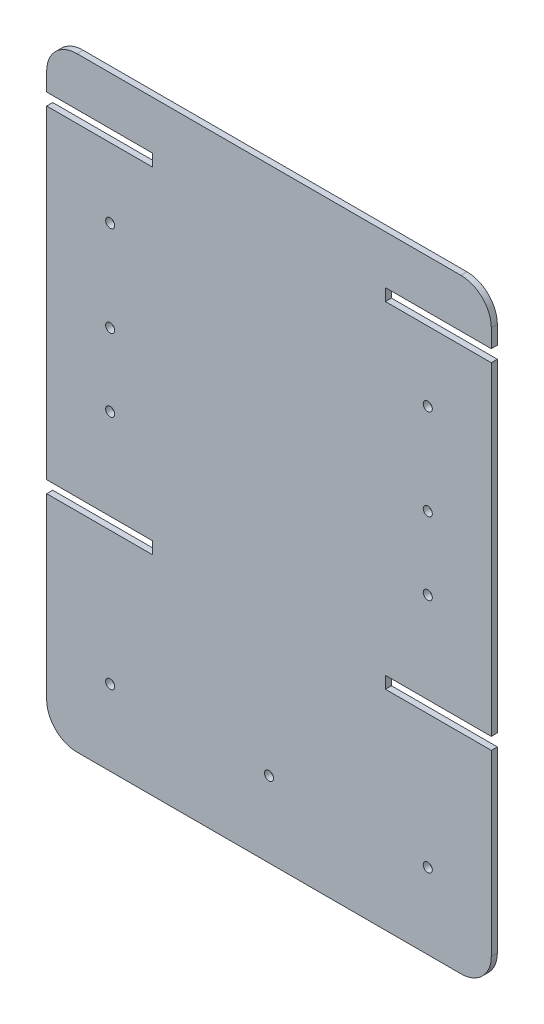
ISO-10303-21;
HEADER;
FILE_DESCRIPTION(('STEP AP214'),'2;1');
FILE_NAME('part.step','',(''),(''),'','','');
FILE_SCHEMA(('AUTOMOTIVE_DESIGN { 1 0 10303 214 1 1 1 1 }'));
ENDSEC;
DATA;
#1=APPLICATION_CONTEXT('core data for automotive mechanical design processes');
#2=APPLICATION_PROTOCOL_DEFINITION('international standard','automotive_design',2000,#1);
#3=PRODUCT_CONTEXT('',#1,'mechanical');
#4=PRODUCT('Part','Part','',(#3));
#5=PRODUCT_RELATED_PRODUCT_CATEGORY('part','',(#4));
#6=PRODUCT_DEFINITION_FORMATION('','',#4);
#7=PRODUCT_DEFINITION_CONTEXT('part definition',#1,'design');
#8=PRODUCT_DEFINITION('design','',#6,#7);
#9=PRODUCT_DEFINITION_SHAPE('','',#8);
#10=(LENGTH_UNIT() NAMED_UNIT(*) SI_UNIT(.MILLI.,.METRE.));
#11=(NAMED_UNIT(*) PLANE_ANGLE_UNIT() SI_UNIT($,.RADIAN.));
#12=(NAMED_UNIT(*) SI_UNIT($,.STERADIAN.) SOLID_ANGLE_UNIT());
#13=UNCERTAINTY_MEASURE_WITH_UNIT(LENGTH_MEASURE(1.E-05),#10,'distance_accuracy_value','');
#14=(GEOMETRIC_REPRESENTATION_CONTEXT(3) GLOBAL_UNCERTAINTY_ASSIGNED_CONTEXT((#13)) GLOBAL_UNIT_ASSIGNED_CONTEXT((#10,
#11,#12)) REPRESENTATION_CONTEXT('',''));
#15=CARTESIAN_POINT('',(0.,0.,0.));
#16=DIRECTION('',(0.,0.,1.));
#17=DIRECTION('',(1.,0.,0.));
#18=AXIS2_PLACEMENT_3D('',#15,#16,#17);
#19=CARTESIAN_POINT('',(-73.5,80.,2.));
#20=DIRECTION('',(0.,-1.,0.));
#21=DIRECTION('',(1.,0.,0.));
#22=AXIS2_PLACEMENT_3D('',#19,#20,#21);
#23=PLANE('',#22);
#24=DIRECTION('',(-1.,0.,0.));
#25=VECTOR('',#24,1.);
#26=CARTESIAN_POINT('',(-73.5,80.,0.));
#27=LINE('',#26,#25);
#28=CARTESIAN_POINT('',(-38.5,80.,0.));
#29=VERTEX_POINT('',#28);
#30=CARTESIAN_POINT('',(-73.5,80.,0.));
#31=VERTEX_POINT('',#30);
#32=EDGE_CURVE('E225',#29,#31,#27,.T.);
#33=ORIENTED_EDGE('',*,*,#32,.T.);
#34=DIRECTION('',(0.,0.,-1.));
#35=VECTOR('',#34,1.);
#36=CARTESIAN_POINT('',(-73.5,80.,2.));
#37=LINE('',#36,#35);
#38=CARTESIAN_POINT('',(-73.5,80.,2.));
#39=VERTEX_POINT('',#38);
#40=EDGE_CURVE('E11',#39,#31,#37,.T.);
#41=ORIENTED_EDGE('',*,*,#40,.F.);
#42=DIRECTION('',(-1.,0.,0.));
#43=VECTOR('',#42,1.);
#44=CARTESIAN_POINT('',(-73.5,80.,2.));
#45=LINE('',#44,#43);
#46=CARTESIAN_POINT('',(-38.5,80.,2.));
#47=VERTEX_POINT('',#46);
#48=EDGE_CURVE('E272',#47,#39,#45,.T.);
#49=ORIENTED_EDGE('',*,*,#48,.F.);
#50=DIRECTION('',(0.,0.,-1.));
#51=VECTOR('',#50,1.);
#52=CARTESIAN_POINT('',(-38.5,80.,2.));
#53=LINE('',#52,#51);
#54=EDGE_CURVE('E221',#47,#29,#53,.T.);
#55=ORIENTED_EDGE('',*,*,#54,.T.);
#56=EDGE_LOOP('',(#33,#41,#49,#55));
#57=FACE_BOUND('',#56,.T.);
#58=ADVANCED_FACE('F33',(#57),#23,.F.);
#59=CARTESIAN_POINT('',(-73.5,-27.,2.));
#60=DIRECTION('',(1.,0.,0.));
#61=DIRECTION('',(0.,0.,-1.));
#62=AXIS2_PLACEMENT_3D('',#59,#60,#61);
#63=PLANE('',#62);
#64=DIRECTION('',(0.,-1.,0.));
#65=VECTOR('',#64,1.);
#66=CARTESIAN_POINT('',(-73.5,-27.,0.));
#67=LINE('',#66,#65);
#68=CARTESIAN_POINT('',(-73.5,-27.,0.));
#69=VERTEX_POINT('',#68);
#70=EDGE_CURVE('E228',#31,#69,#67,.T.);
#71=ORIENTED_EDGE('',*,*,#70,.T.);
#72=DIRECTION('',(0.,0.,-1.));
#73=VECTOR('',#72,1.);
#74=CARTESIAN_POINT('',(-73.5,-27.,2.));
#75=LINE('',#74,#73);
#76=CARTESIAN_POINT('',(-73.5,-27.,2.));
#77=VERTEX_POINT('',#76);
#78=EDGE_CURVE('E41',#77,#69,#75,.T.);
#79=ORIENTED_EDGE('',*,*,#78,.F.);
#80=DIRECTION('',(0.,-1.,0.));
#81=VECTOR('',#80,1.);
#82=CARTESIAN_POINT('',(-73.5,-27.,2.));
#83=LINE('',#82,#81);
#84=EDGE_CURVE('E140',#39,#77,#83,.T.);
#85=ORIENTED_EDGE('',*,*,#84,.F.);
#86=ORIENTED_EDGE('',*,*,#40,.T.);
#87=EDGE_LOOP('',(#71,#79,#85,#86));
#88=FACE_BOUND('',#87,.T.);
#89=ADVANCED_FACE('F411',(#88),#63,.F.);
#90=CARTESIAN_POINT('',(-73.5,-27.,2.));
#91=DIRECTION('',(0.,1.,0.));
#92=DIRECTION('',(0.,0.,1.));
#93=AXIS2_PLACEMENT_3D('',#90,#91,#92);
#94=PLANE('',#93);
#95=DIRECTION('',(1.,0.,0.));
#96=VECTOR('',#95,1.);
#97=CARTESIAN_POINT('',(-73.5,-27.,0.));
#98=LINE('',#97,#96);
#99=CARTESIAN_POINT('',(-38.5,-27.,0.));
#100=VERTEX_POINT('',#99);
#101=EDGE_CURVE('E231',#69,#100,#98,.T.);
#102=ORIENTED_EDGE('',*,*,#101,.T.);
#103=DIRECTION('',(0.,0.,-1.));
#104=VECTOR('',#103,1.);
#105=CARTESIAN_POINT('',(-38.5,-27.,2.));
#106=LINE('',#105,#104);
#107=CARTESIAN_POINT('',(-38.5,-27.,2.));
#108=VERTEX_POINT('',#107);
#109=EDGE_CURVE('E327',#108,#100,#106,.T.);
#110=ORIENTED_EDGE('',*,*,#109,.F.);
#111=DIRECTION('',(1.,0.,0.));
#112=VECTOR('',#111,1.);
#113=CARTESIAN_POINT('',(-73.5,-27.,2.));
#114=LINE('',#113,#112);
#115=EDGE_CURVE('E335',#77,#108,#114,.T.);
#116=ORIENTED_EDGE('',*,*,#115,.F.);
#117=ORIENTED_EDGE('',*,*,#78,.T.);
#118=EDGE_LOOP('',(#102,#110,#116,#117));
#119=FACE_BOUND('',#118,.T.);
#120=ADVANCED_FACE('F333',(#119),#94,.F.);
#121=CARTESIAN_POINT('',(-38.5,-27.,2.));
#122=DIRECTION('',(1.,0.,0.));
#123=DIRECTION('',(0.,0.,-1.));
#124=AXIS2_PLACEMENT_3D('',#121,#122,#123);
#125=PLANE('',#124);
#126=DIRECTION('',(0.,-1.,0.));
#127=VECTOR('',#126,1.);
#128=CARTESIAN_POINT('',(-38.5,-27.,0.));
#129=LINE('',#128,#127);
#130=CARTESIAN_POINT('',(-38.5,-31.,0.));
#131=VERTEX_POINT('',#130);
#132=EDGE_CURVE('E233',#100,#131,#129,.T.);
#133=ORIENTED_EDGE('',*,*,#132,.T.);
#134=DIRECTION('',(0.,0.,-1.));
#135=VECTOR('',#134,1.);
#136=CARTESIAN_POINT('',(-38.5,-31.,2.));
#137=LINE('',#136,#135);
#138=CARTESIAN_POINT('',(-38.5,-31.,2.));
#139=VERTEX_POINT('',#138);
#140=EDGE_CURVE('E324',#139,#131,#137,.T.);
#141=ORIENTED_EDGE('',*,*,#140,.F.);
#142=DIRECTION('',(0.,-1.,0.));
#143=VECTOR('',#142,1.);
#144=CARTESIAN_POINT('',(-38.5,-27.,2.));
#145=LINE('',#144,#143);
#146=EDGE_CURVE('E353',#108,#139,#145,.T.);
#147=ORIENTED_EDGE('',*,*,#146,.F.);
#148=ORIENTED_EDGE('',*,*,#109,.T.);
#149=EDGE_LOOP('',(#133,#141,#147,#148));
#150=FACE_BOUND('',#149,.T.);
#151=ADVANCED_FACE('F344',(#150),#125,.F.);
#152=CARTESIAN_POINT('',(-73.5,-31.,2.));
#153=DIRECTION('',(0.,-1.,0.));
#154=DIRECTION('',(1.,0.,0.));
#155=AXIS2_PLACEMENT_3D('',#152,#153,#154);
#156=PLANE('',#155);
#157=DIRECTION('',(-1.,0.,0.));
#158=VECTOR('',#157,1.);
#159=CARTESIAN_POINT('',(-73.5,-31.,0.));
#160=LINE('',#159,#158);
#161=CARTESIAN_POINT('',(-73.5,-31.,0.));
#162=VERTEX_POINT('',#161);
#163=EDGE_CURVE('E235',#131,#162,#160,.T.);
#164=ORIENTED_EDGE('',*,*,#163,.T.);
#165=DIRECTION('',(0.,0.,-1.));
#166=VECTOR('',#165,1.);
#167=CARTESIAN_POINT('',(-73.5,-31.,2.));
#168=LINE('',#167,#166);
#169=CARTESIAN_POINT('',(-73.5,-31.,2.));
#170=VERTEX_POINT('',#169);
#171=EDGE_CURVE('E321',#170,#162,#168,.T.);
#172=ORIENTED_EDGE('',*,*,#171,.F.);
#173=DIRECTION('',(-1.,0.,0.));
#174=VECTOR('',#173,1.);
#175=CARTESIAN_POINT('',(-73.5,-31.,2.));
#176=LINE('',#175,#174);
#177=EDGE_CURVE('E350',#139,#170,#176,.T.);
#178=ORIENTED_EDGE('',*,*,#177,.F.);
#179=ORIENTED_EDGE('',*,*,#140,.T.);
#180=EDGE_LOOP('',(#164,#172,#178,#179));
#181=FACE_BOUND('',#180,.T.);
#182=ADVANCED_FACE('F348',(#181),#156,.F.);
#183=CARTESIAN_POINT('',(-73.5,-89.9999999999999,2.));
#184=DIRECTION('',(1.,0.,0.));
#185=DIRECTION('',(0.,0.,-1.));
#186=AXIS2_PLACEMENT_3D('',#183,#184,#185);
#187=PLANE('',#186);
#188=DIRECTION('',(0.,-1.,0.));
#189=VECTOR('',#188,1.);
#190=CARTESIAN_POINT('',(-73.5,-89.9999999999999,0.));
#191=LINE('',#190,#189);
#192=CARTESIAN_POINT('',(-73.5,-89.9999999999999,0.));
#193=VERTEX_POINT('',#192);
#194=EDGE_CURVE('E237',#162,#193,#191,.T.);
#195=ORIENTED_EDGE('',*,*,#194,.T.);
#196=DIRECTION('',(0.,0.,-1.));
#197=VECTOR('',#196,1.);
#198=CARTESIAN_POINT('',(-73.5,-89.9999999999999,2.));
#199=LINE('',#198,#197);
#200=CARTESIAN_POINT('',(-73.5,-89.9999999999999,2.));
#201=VERTEX_POINT('',#200);
#202=EDGE_CURVE('E318',#201,#193,#199,.T.);
#203=ORIENTED_EDGE('',*,*,#202,.F.);
#204=DIRECTION('',(0.,-1.,0.));
#205=VECTOR('',#204,1.);
#206=CARTESIAN_POINT('',(-73.5,-89.9999999999999,2.));
#207=LINE('',#206,#205);
#208=EDGE_CURVE('E352',#170,#201,#207,.T.);
#209=ORIENTED_EDGE('',*,*,#208,.F.);
#210=ORIENTED_EDGE('',*,*,#171,.T.);
#211=EDGE_LOOP('',(#195,#203,#209,#210));
#212=FACE_BOUND('',#211,.T.);
#213=ADVANCED_FACE('F424',(#212),#187,.F.);
#214=CARTESIAN_POINT('',(-63.5,-90.,2.));
#215=DIRECTION('',(0.,0.,-1.));
#216=DIRECTION('',(-1.,0.,0.));
#217=AXIS2_PLACEMENT_3D('',#214,#215,#216);
#218=CYLINDRICAL_SURFACE('',#217,9.99999999999999);
#219=CARTESIAN_POINT('',(-63.5,-90.,0.));
#220=DIRECTION('',(0.,0.,1.));
#221=DIRECTION('',(-1.,0.,0.));
#222=AXIS2_PLACEMENT_3D('',#219,#220,#221);
#223=CIRCLE('',#222,9.99999999999999);
#224=CARTESIAN_POINT('',(-63.4999999999999,-100.,0.));
#225=VERTEX_POINT('',#224);
#226=EDGE_CURVE('E239',#193,#225,#223,.T.);
#227=ORIENTED_EDGE('',*,*,#226,.T.);
#228=DIRECTION('',(0.,0.,-1.));
#229=VECTOR('',#228,1.);
#230=CARTESIAN_POINT('',(-63.4999999999999,-100.,2.));
#231=LINE('',#230,#229);
#232=CARTESIAN_POINT('',(-63.4999999999999,-100.,2.));
#233=VERTEX_POINT('',#232);
#234=EDGE_CURVE('E315',#233,#225,#231,.T.);
#235=ORIENTED_EDGE('',*,*,#234,.F.);
#236=CARTESIAN_POINT('',(-63.5,-90.,2.));
#237=DIRECTION('',(0.,0.,1.));
#238=DIRECTION('',(-1.,0.,0.));
#239=AXIS2_PLACEMENT_3D('',#236,#237,#238);
#240=CIRCLE('',#239,9.99999999999999);
#241=EDGE_CURVE('E355',#201,#233,#240,.T.);
#242=ORIENTED_EDGE('',*,*,#241,.F.);
#243=ORIENTED_EDGE('',*,*,#202,.T.);
#244=EDGE_LOOP('',(#227,#235,#242,#243));
#245=FACE_BOUND('',#244,.T.);
#246=ADVANCED_FACE('F427',(#245),#218,.T.);
#247=CARTESIAN_POINT('',(-63.4999999999999,-100.,2.));
#248=DIRECTION('',(0.,1.,0.));
#249=DIRECTION('',(0.,0.,1.));
#250=AXIS2_PLACEMENT_3D('',#247,#248,#249);
#251=PLANE('',#250);
#252=DIRECTION('',(1.,0.,0.));
#253=VECTOR('',#252,1.);
#254=CARTESIAN_POINT('',(-63.4999999999999,-100.,0.));
#255=LINE('',#254,#253);
#256=CARTESIAN_POINT('',(63.4999999999999,-100.,0.));
#257=VERTEX_POINT('',#256);
#258=EDGE_CURVE('E241',#225,#257,#255,.T.);
#259=ORIENTED_EDGE('',*,*,#258,.T.);
#260=DIRECTION('',(0.,0.,-1.));
#261=VECTOR('',#260,1.);
#262=CARTESIAN_POINT('',(63.4999999999999,-100.,2.));
#263=LINE('',#262,#261);
#264=CARTESIAN_POINT('',(63.4999999999999,-100.,2.));
#265=VERTEX_POINT('',#264);
#266=EDGE_CURVE('E312',#265,#257,#263,.T.);
#267=ORIENTED_EDGE('',*,*,#266,.F.);
#268=DIRECTION('',(1.,0.,0.));
#269=VECTOR('',#268,1.);
#270=CARTESIAN_POINT('',(-63.4999999999999,-100.,2.));
#271=LINE('',#270,#269);
#272=EDGE_CURVE('E361',#233,#265,#271,.T.);
#273=ORIENTED_EDGE('',*,*,#272,.F.);
#274=ORIENTED_EDGE('',*,*,#234,.T.);
#275=EDGE_LOOP('',(#259,#267,#273,#274));
#276=FACE_BOUND('',#275,.T.);
#277=ADVANCED_FACE('F431',(#276),#251,.F.);
#278=CARTESIAN_POINT('',(63.5,-90.,2.));
#279=DIRECTION('',(0.,0.,-1.));
#280=DIRECTION('',(-1.,0.,0.));
#281=AXIS2_PLACEMENT_3D('',#278,#279,#280);
#282=CYLINDRICAL_SURFACE('',#281,9.99999999999999);
#283=CARTESIAN_POINT('',(63.5,-90.,0.));
#284=DIRECTION('',(0.,0.,1.));
#285=DIRECTION('',(1.,0.,0.));
#286=AXIS2_PLACEMENT_3D('',#283,#284,#285);
#287=CIRCLE('',#286,9.99999999999999);
#288=CARTESIAN_POINT('',(73.5,-89.9999999999999,0.));
#289=VERTEX_POINT('',#288);
#290=EDGE_CURVE('E243',#257,#289,#287,.T.);
#291=ORIENTED_EDGE('',*,*,#290,.T.);
#292=DIRECTION('',(0.,0.,-1.));
#293=VECTOR('',#292,1.);
#294=CARTESIAN_POINT('',(73.5,-89.9999999999999,2.));
#295=LINE('',#294,#293);
#296=CARTESIAN_POINT('',(73.5,-89.9999999999999,2.));
#297=VERTEX_POINT('',#296);
#298=EDGE_CURVE('E309',#297,#289,#295,.T.);
#299=ORIENTED_EDGE('',*,*,#298,.F.);
#300=CARTESIAN_POINT('',(63.5,-90.,2.));
#301=DIRECTION('',(0.,0.,1.));
#302=DIRECTION('',(1.,0.,0.));
#303=AXIS2_PLACEMENT_3D('',#300,#301,#302);
#304=CIRCLE('',#303,9.99999999999999);
#305=EDGE_CURVE('E363',#265,#297,#304,.T.);
#306=ORIENTED_EDGE('',*,*,#305,.F.);
#307=ORIENTED_EDGE('',*,*,#266,.T.);
#308=EDGE_LOOP('',(#291,#299,#306,#307));
#309=FACE_BOUND('',#308,.T.);
#310=ADVANCED_FACE('F435',(#309),#282,.T.);
#311=CARTESIAN_POINT('',(73.5,-89.9999999999999,2.));
#312=DIRECTION('',(-1.,0.,0.));
#313=DIRECTION('',(0.,0.,1.));
#314=AXIS2_PLACEMENT_3D('',#311,#312,#313);
#315=PLANE('',#314);
#316=DIRECTION('',(0.,1.,0.));
#317=VECTOR('',#316,1.);
#318=CARTESIAN_POINT('',(73.5,-89.9999999999999,0.));
#319=LINE('',#318,#317);
#320=CARTESIAN_POINT('',(73.5,-30.9999999999999,0.));
#321=VERTEX_POINT('',#320);
#322=EDGE_CURVE('E245',#289,#321,#319,.T.);
#323=ORIENTED_EDGE('',*,*,#322,.T.);
#324=DIRECTION('',(0.,0.,-1.));
#325=VECTOR('',#324,1.);
#326=CARTESIAN_POINT('',(73.5,-30.9999999999999,2.));
#327=LINE('',#326,#325);
#328=CARTESIAN_POINT('',(73.5,-30.9999999999999,2.));
#329=VERTEX_POINT('',#328);
#330=EDGE_CURVE('E306',#329,#321,#327,.T.);
#331=ORIENTED_EDGE('',*,*,#330,.F.);
#332=DIRECTION('',(0.,1.,0.));
#333=VECTOR('',#332,1.);
#334=CARTESIAN_POINT('',(73.5,-89.9999999999999,2.));
#335=LINE('',#334,#333);
#336=EDGE_CURVE('E365',#297,#329,#335,.T.);
#337=ORIENTED_EDGE('',*,*,#336,.F.);
#338=ORIENTED_EDGE('',*,*,#298,.T.);
#339=EDGE_LOOP('',(#323,#331,#337,#338));
#340=FACE_BOUND('',#339,.T.);
#341=ADVANCED_FACE('F439',(#340),#315,.F.);
#342=CARTESIAN_POINT('',(73.5,-30.9999999999999,2.));
#343=DIRECTION('',(0.,-1.,0.));
#344=DIRECTION('',(1.,0.,0.));
#345=AXIS2_PLACEMENT_3D('',#342,#343,#344);
#346=PLANE('',#345);
#347=DIRECTION('',(-1.,0.,0.));
#348=VECTOR('',#347,1.);
#349=CARTESIAN_POINT('',(73.5,-30.9999999999999,0.));
#350=LINE('',#349,#348);
#351=CARTESIAN_POINT('',(38.5,-30.9999999999999,0.));
#352=VERTEX_POINT('',#351);
#353=EDGE_CURVE('E247',#321,#352,#350,.T.);
#354=ORIENTED_EDGE('',*,*,#353,.T.);
#355=DIRECTION('',(0.,0.,-1.));
#356=VECTOR('',#355,1.);
#357=CARTESIAN_POINT('',(38.5,-30.9999999999999,2.));
#358=LINE('',#357,#356);
#359=CARTESIAN_POINT('',(38.5,-30.9999999999999,2.));
#360=VERTEX_POINT('',#359);
#361=EDGE_CURVE('E303',#360,#352,#358,.T.);
#362=ORIENTED_EDGE('',*,*,#361,.F.);
#363=DIRECTION('',(-1.,0.,0.));
#364=VECTOR('',#363,1.);
#365=CARTESIAN_POINT('',(73.5,-30.9999999999999,2.));
#366=LINE('',#365,#364);
#367=EDGE_CURVE('E367',#329,#360,#366,.T.);
#368=ORIENTED_EDGE('',*,*,#367,.F.);
#369=ORIENTED_EDGE('',*,*,#330,.T.);
#370=EDGE_LOOP('',(#354,#362,#368,#369));
#371=FACE_BOUND('',#370,.T.);
#372=ADVANCED_FACE('F443',(#371),#346,.F.);
#373=CARTESIAN_POINT('',(38.5,-26.9999999999999,2.));
#374=DIRECTION('',(-1.,0.,0.));
#375=DIRECTION('',(0.,0.,1.));
#376=AXIS2_PLACEMENT_3D('',#373,#374,#375);
#377=PLANE('',#376);
#378=DIRECTION('',(0.,1.,0.));
#379=VECTOR('',#378,1.);
#380=CARTESIAN_POINT('',(38.5,-26.9999999999999,0.));
#381=LINE('',#380,#379);
#382=CARTESIAN_POINT('',(38.5,-26.9999999999999,0.));
#383=VERTEX_POINT('',#382);
#384=EDGE_CURVE('E249',#352,#383,#381,.T.);
#385=ORIENTED_EDGE('',*,*,#384,.T.);
#386=DIRECTION('',(0.,0.,-1.));
#387=VECTOR('',#386,1.);
#388=CARTESIAN_POINT('',(38.5,-26.9999999999999,2.));
#389=LINE('',#388,#387);
#390=CARTESIAN_POINT('',(38.5,-26.9999999999999,2.));
#391=VERTEX_POINT('',#390);
#392=EDGE_CURVE('E300',#391,#383,#389,.T.);
#393=ORIENTED_EDGE('',*,*,#392,.F.);
#394=DIRECTION('',(0.,1.,0.));
#395=VECTOR('',#394,1.);
#396=CARTESIAN_POINT('',(38.5,-26.9999999999999,2.));
#397=LINE('',#396,#395);
#398=EDGE_CURVE('E369',#360,#391,#397,.T.);
#399=ORIENTED_EDGE('',*,*,#398,.F.);
#400=ORIENTED_EDGE('',*,*,#361,.T.);
#401=EDGE_LOOP('',(#385,#393,#399,#400));
#402=FACE_BOUND('',#401,.T.);
#403=ADVANCED_FACE('F447',(#402),#377,.F.);
#404=CARTESIAN_POINT('',(73.5,-26.9999999999999,2.));
#405=DIRECTION('',(0.,1.,0.));
#406=DIRECTION('',(0.,0.,1.));
#407=AXIS2_PLACEMENT_3D('',#404,#405,#406);
#408=PLANE('',#407);
#409=DIRECTION('',(1.,0.,0.));
#410=VECTOR('',#409,1.);
#411=CARTESIAN_POINT('',(73.5,-26.9999999999999,0.));
#412=LINE('',#411,#410);
#413=CARTESIAN_POINT('',(73.5,-26.9999999999999,0.));
#414=VERTEX_POINT('',#413);
#415=EDGE_CURVE('E251',#383,#414,#412,.T.);
#416=ORIENTED_EDGE('',*,*,#415,.T.);
#417=DIRECTION('',(0.,0.,-1.));
#418=VECTOR('',#417,1.);
#419=CARTESIAN_POINT('',(73.5,-26.9999999999999,2.));
#420=LINE('',#419,#418);
#421=CARTESIAN_POINT('',(73.5,-26.9999999999999,2.));
#422=VERTEX_POINT('',#421);
#423=EDGE_CURVE('E297',#422,#414,#420,.T.);
#424=ORIENTED_EDGE('',*,*,#423,.F.);
#425=DIRECTION('',(1.,0.,0.));
#426=VECTOR('',#425,1.);
#427=CARTESIAN_POINT('',(73.5,-26.9999999999999,2.));
#428=LINE('',#427,#426);
#429=EDGE_CURVE('E371',#391,#422,#428,.T.);
#430=ORIENTED_EDGE('',*,*,#429,.F.);
#431=ORIENTED_EDGE('',*,*,#392,.T.);
#432=EDGE_LOOP('',(#416,#424,#430,#431));
#433=FACE_BOUND('',#432,.T.);
#434=ADVANCED_FACE('F451',(#433),#408,.F.);
#435=CARTESIAN_POINT('',(73.5,-26.9999999999999,2.));
#436=DIRECTION('',(-1.,0.,0.));
#437=DIRECTION('',(0.,0.,1.));
#438=AXIS2_PLACEMENT_3D('',#435,#436,#437);
#439=PLANE('',#438);
#440=DIRECTION('',(0.,1.,0.));
#441=VECTOR('',#440,1.);
#442=CARTESIAN_POINT('',(73.5,-26.9999999999999,0.));
#443=LINE('',#442,#441);
#444=CARTESIAN_POINT('',(73.5,80.,0.));
#445=VERTEX_POINT('',#444);
#446=EDGE_CURVE('E253',#414,#445,#443,.T.);
#447=ORIENTED_EDGE('',*,*,#446,.T.);
#448=DIRECTION('',(0.,0.,-1.));
#449=VECTOR('',#448,1.);
#450=CARTESIAN_POINT('',(73.5,80.,2.));
#451=LINE('',#450,#449);
#452=CARTESIAN_POINT('',(73.5,80.,2.));
#453=VERTEX_POINT('',#452);
#454=EDGE_CURVE('E294',#453,#445,#451,.T.);
#455=ORIENTED_EDGE('',*,*,#454,.F.);
#456=DIRECTION('',(0.,1.,0.));
#457=VECTOR('',#456,1.);
#458=CARTESIAN_POINT('',(73.5,-26.9999999999999,2.));
#459=LINE('',#458,#457);
#460=EDGE_CURVE('E373',#422,#453,#459,.T.);
#461=ORIENTED_EDGE('',*,*,#460,.F.);
#462=ORIENTED_EDGE('',*,*,#423,.T.);
#463=EDGE_LOOP('',(#447,#455,#461,#462));
#464=FACE_BOUND('',#463,.T.);
#465=ADVANCED_FACE('F455',(#464),#439,.F.);
#466=CARTESIAN_POINT('',(73.5,80.,2.));
#467=DIRECTION('',(0.,-1.,0.));
#468=DIRECTION('',(1.,0.,0.));
#469=AXIS2_PLACEMENT_3D('',#466,#467,#468);
#470=PLANE('',#469);
#471=DIRECTION('',(-1.,0.,0.));
#472=VECTOR('',#471,1.);
#473=CARTESIAN_POINT('',(73.5,80.,0.));
#474=LINE('',#473,#472);
#475=CARTESIAN_POINT('',(38.5,80.,0.));
#476=VERTEX_POINT('',#475);
#477=EDGE_CURVE('E255',#445,#476,#474,.T.);
#478=ORIENTED_EDGE('',*,*,#477,.T.);
#479=DIRECTION('',(0.,0.,-1.));
#480=VECTOR('',#479,1.);
#481=CARTESIAN_POINT('',(38.5,80.,2.));
#482=LINE('',#481,#480);
#483=CARTESIAN_POINT('',(38.5,80.,2.));
#484=VERTEX_POINT('',#483);
#485=EDGE_CURVE('E291',#484,#476,#482,.T.);
#486=ORIENTED_EDGE('',*,*,#485,.F.);
#487=DIRECTION('',(-1.,0.,0.));
#488=VECTOR('',#487,1.);
#489=CARTESIAN_POINT('',(73.5,80.,2.));
#490=LINE('',#489,#488);
#491=EDGE_CURVE('E375',#453,#484,#490,.T.);
#492=ORIENTED_EDGE('',*,*,#491,.F.);
#493=ORIENTED_EDGE('',*,*,#454,.T.);
#494=EDGE_LOOP('',(#478,#486,#492,#493));
#495=FACE_BOUND('',#494,.T.);
#496=ADVANCED_FACE('F459',(#495),#470,.F.);
#497=CARTESIAN_POINT('',(38.5,80.,2.));
#498=DIRECTION('',(-1.,0.,0.));
#499=DIRECTION('',(0.,0.,1.));
#500=AXIS2_PLACEMENT_3D('',#497,#498,#499);
#501=PLANE('',#500);
#502=DIRECTION('',(0.,1.,0.));
#503=VECTOR('',#502,1.);
#504=CARTESIAN_POINT('',(38.5,80.,0.));
#505=LINE('',#504,#503);
#506=CARTESIAN_POINT('',(38.5,84.,0.));
#507=VERTEX_POINT('',#506);
#508=EDGE_CURVE('E257',#476,#507,#505,.T.);
#509=ORIENTED_EDGE('',*,*,#508,.T.);
#510=DIRECTION('',(0.,0.,-1.));
#511=VECTOR('',#510,1.);
#512=CARTESIAN_POINT('',(38.5,84.,2.));
#513=LINE('',#512,#511);
#514=CARTESIAN_POINT('',(38.5,84.,2.));
#515=VERTEX_POINT('',#514);
#516=EDGE_CURVE('E288',#515,#507,#513,.T.);
#517=ORIENTED_EDGE('',*,*,#516,.F.);
#518=DIRECTION('',(0.,1.,0.));
#519=VECTOR('',#518,1.);
#520=CARTESIAN_POINT('',(38.5,80.,2.));
#521=LINE('',#520,#519);
#522=EDGE_CURVE('E377',#484,#515,#521,.T.);
#523=ORIENTED_EDGE('',*,*,#522,.F.);
#524=ORIENTED_EDGE('',*,*,#485,.T.);
#525=EDGE_LOOP('',(#509,#517,#523,#524));
#526=FACE_BOUND('',#525,.T.);
#527=ADVANCED_FACE('F463',(#526),#501,.F.);
#528=CARTESIAN_POINT('',(73.5,84.,2.));
#529=DIRECTION('',(0.,1.,0.));
#530=DIRECTION('',(0.,0.,1.));
#531=AXIS2_PLACEMENT_3D('',#528,#529,#530);
#532=PLANE('',#531);
#533=DIRECTION('',(1.,0.,0.));
#534=VECTOR('',#533,1.);
#535=CARTESIAN_POINT('',(73.5,84.,0.));
#536=LINE('',#535,#534);
#537=CARTESIAN_POINT('',(73.5,84.,0.));
#538=VERTEX_POINT('',#537);
#539=EDGE_CURVE('E259',#507,#538,#536,.T.);
#540=ORIENTED_EDGE('',*,*,#539,.T.);
#541=DIRECTION('',(0.,0.,-1.));
#542=VECTOR('',#541,1.);
#543=CARTESIAN_POINT('',(73.5,84.,2.));
#544=LINE('',#543,#542);
#545=CARTESIAN_POINT('',(73.5,84.,2.));
#546=VERTEX_POINT('',#545);
#547=EDGE_CURVE('E285',#546,#538,#544,.T.);
#548=ORIENTED_EDGE('',*,*,#547,.F.);
#549=DIRECTION('',(1.,0.,0.));
#550=VECTOR('',#549,1.);
#551=CARTESIAN_POINT('',(73.5,84.,2.));
#552=LINE('',#551,#550);
#553=EDGE_CURVE('E379',#515,#546,#552,.T.);
#554=ORIENTED_EDGE('',*,*,#553,.F.);
#555=ORIENTED_EDGE('',*,*,#516,.T.);
#556=EDGE_LOOP('',(#540,#548,#554,#555));
#557=FACE_BOUND('',#556,.T.);
#558=ADVANCED_FACE('F467',(#557),#532,.F.);
#559=CARTESIAN_POINT('',(73.5,84.,2.));
#560=DIRECTION('',(-1.,0.,0.));
#561=DIRECTION('',(0.,0.,1.));
#562=AXIS2_PLACEMENT_3D('',#559,#560,#561);
#563=PLANE('',#562);
#564=DIRECTION('',(0.,1.,0.));
#565=VECTOR('',#564,1.);
#566=CARTESIAN_POINT('',(73.5,84.,0.));
#567=LINE('',#566,#565);
#568=CARTESIAN_POINT('',(73.5,89.9999999999999,0.));
#569=VERTEX_POINT('',#568);
#570=EDGE_CURVE('E261',#538,#569,#567,.T.);
#571=ORIENTED_EDGE('',*,*,#570,.T.);
#572=DIRECTION('',(0.,0.,-1.));
#573=VECTOR('',#572,1.);
#574=CARTESIAN_POINT('',(73.5,89.9999999999999,2.));
#575=LINE('',#574,#573);
#576=CARTESIAN_POINT('',(73.5,89.9999999999999,2.));
#577=VERTEX_POINT('',#576);
#578=EDGE_CURVE('E282',#577,#569,#575,.T.);
#579=ORIENTED_EDGE('',*,*,#578,.F.);
#580=DIRECTION('',(0.,1.,0.));
#581=VECTOR('',#580,1.);
#582=CARTESIAN_POINT('',(73.5,84.,2.));
#583=LINE('',#582,#581);
#584=EDGE_CURVE('E381',#546,#577,#583,.T.);
#585=ORIENTED_EDGE('',*,*,#584,.F.);
#586=ORIENTED_EDGE('',*,*,#547,.T.);
#587=EDGE_LOOP('',(#571,#579,#585,#586));
#588=FACE_BOUND('',#587,.T.);
#589=ADVANCED_FACE('F471',(#588),#563,.F.);
#590=CARTESIAN_POINT('',(63.5,90.,2.));
#591=DIRECTION('',(0.,0.,-1.));
#592=DIRECTION('',(-1.,0.,0.));
#593=AXIS2_PLACEMENT_3D('',#590,#591,#592);
#594=CYLINDRICAL_SURFACE('',#593,9.99999999999999);
#595=CARTESIAN_POINT('',(63.5,90.,0.));
#596=DIRECTION('',(0.,0.,1.));
#597=DIRECTION('',(1.,0.,0.));
#598=AXIS2_PLACEMENT_3D('',#595,#596,#597);
#599=CIRCLE('',#598,9.99999999999999);
#600=CARTESIAN_POINT('',(63.4999999999999,100.,0.));
#601=VERTEX_POINT('',#600);
#602=EDGE_CURVE('E263',#569,#601,#599,.T.);
#603=ORIENTED_EDGE('',*,*,#602,.T.);
#604=DIRECTION('',(0.,0.,-1.));
#605=VECTOR('',#604,1.);
#606=CARTESIAN_POINT('',(63.4999999999999,100.,2.));
#607=LINE('',#606,#605);
#608=CARTESIAN_POINT('',(63.4999999999999,100.,2.));
#609=VERTEX_POINT('',#608);
#610=EDGE_CURVE('E279',#609,#601,#607,.T.);
#611=ORIENTED_EDGE('',*,*,#610,.F.);
#612=CARTESIAN_POINT('',(63.5,90.,2.));
#613=DIRECTION('',(0.,0.,1.));
#614=DIRECTION('',(1.,0.,0.));
#615=AXIS2_PLACEMENT_3D('',#612,#613,#614);
#616=CIRCLE('',#615,9.99999999999999);
#617=EDGE_CURVE('E383',#577,#609,#616,.T.);
#618=ORIENTED_EDGE('',*,*,#617,.F.);
#619=ORIENTED_EDGE('',*,*,#578,.T.);
#620=EDGE_LOOP('',(#603,#611,#618,#619));
#621=FACE_BOUND('',#620,.T.);
#622=ADVANCED_FACE('F475',(#621),#594,.T.);
#623=CARTESIAN_POINT('',(-63.4999999999999,100.,2.));
#624=DIRECTION('',(0.,-1.,0.));
#625=DIRECTION('',(0.,0.,-1.));
#626=AXIS2_PLACEMENT_3D('',#623,#624,#625);
#627=PLANE('',#626);
#628=DIRECTION('',(-1.,0.,0.));
#629=VECTOR('',#628,1.);
#630=CARTESIAN_POINT('',(-63.4999999999999,100.,0.));
#631=LINE('',#630,#629);
#632=CARTESIAN_POINT('',(-63.4999999999999,100.,0.));
#633=VERTEX_POINT('',#632);
#634=EDGE_CURVE('E265',#601,#633,#631,.T.);
#635=ORIENTED_EDGE('',*,*,#634,.T.);
#636=DIRECTION('',(0.,0.,-1.));
#637=VECTOR('',#636,1.);
#638=CARTESIAN_POINT('',(-63.4999999999999,100.,2.));
#639=LINE('',#638,#637);
#640=CARTESIAN_POINT('',(-63.4999999999999,100.,2.));
#641=VERTEX_POINT('',#640);
#642=EDGE_CURVE('E276',#641,#633,#639,.T.);
#643=ORIENTED_EDGE('',*,*,#642,.F.);
#644=DIRECTION('',(-1.,0.,0.));
#645=VECTOR('',#644,1.);
#646=CARTESIAN_POINT('',(-63.4999999999999,100.,2.));
#647=LINE('',#646,#645);
#648=EDGE_CURVE('E385',#609,#641,#647,.T.);
#649=ORIENTED_EDGE('',*,*,#648,.F.);
#650=ORIENTED_EDGE('',*,*,#610,.T.);
#651=EDGE_LOOP('',(#635,#643,#649,#650));
#652=FACE_BOUND('',#651,.T.);
#653=ADVANCED_FACE('F391',(#652),#627,.F.);
#654=CARTESIAN_POINT('',(-63.5,90.,2.));
#655=DIRECTION('',(0.,0.,-1.));
#656=DIRECTION('',(-1.,0.,0.));
#657=AXIS2_PLACEMENT_3D('',#654,#655,#656);
#658=CYLINDRICAL_SURFACE('',#657,9.99999999999999);
#659=CARTESIAN_POINT('',(-63.5,90.,0.));
#660=DIRECTION('',(0.,0.,1.));
#661=DIRECTION('',(1.,0.,0.));
#662=AXIS2_PLACEMENT_3D('',#659,#660,#661);
#663=CIRCLE('',#662,9.99999999999999);
#664=CARTESIAN_POINT('',(-73.5,89.9999999999999,0.));
#665=VERTEX_POINT('',#664);
#666=EDGE_CURVE('E267',#633,#665,#663,.T.);
#667=ORIENTED_EDGE('',*,*,#666,.T.);
#668=DIRECTION('',(0.,0.,-1.));
#669=VECTOR('',#668,1.);
#670=CARTESIAN_POINT('',(-73.5,89.9999999999999,2.));
#671=LINE('',#670,#669);
#672=CARTESIAN_POINT('',(-73.5,89.9999999999999,2.));
#673=VERTEX_POINT('',#672);
#674=EDGE_CURVE('E216',#673,#665,#671,.T.);
#675=ORIENTED_EDGE('',*,*,#674,.F.);
#676=CARTESIAN_POINT('',(-63.5,90.,2.));
#677=DIRECTION('',(0.,0.,1.));
#678=DIRECTION('',(1.,0.,0.));
#679=AXIS2_PLACEMENT_3D('',#676,#677,#678);
#680=CIRCLE('',#679,9.99999999999999);
#681=EDGE_CURVE('E207',#641,#673,#680,.T.);
#682=ORIENTED_EDGE('',*,*,#681,.F.);
#683=ORIENTED_EDGE('',*,*,#642,.T.);
#684=EDGE_LOOP('',(#667,#675,#682,#683));
#685=FACE_BOUND('',#684,.T.);
#686=ADVANCED_FACE('F395',(#685),#658,.T.);
#687=CARTESIAN_POINT('',(-73.5,84.,2.));
#688=DIRECTION('',(1.,0.,0.));
#689=DIRECTION('',(0.,0.,-1.));
#690=AXIS2_PLACEMENT_3D('',#687,#688,#689);
#691=PLANE('',#690);
#692=DIRECTION('',(0.,-1.,0.));
#693=VECTOR('',#692,1.);
#694=CARTESIAN_POINT('',(-73.5,84.,0.));
#695=LINE('',#694,#693);
#696=CARTESIAN_POINT('',(-73.5,84.,0.));
#697=VERTEX_POINT('',#696);
#698=EDGE_CURVE('E215',#665,#697,#695,.T.);
#699=ORIENTED_EDGE('',*,*,#698,.T.);
#700=DIRECTION('',(0.,0.,-1.));
#701=VECTOR('',#700,1.);
#702=CARTESIAN_POINT('',(-73.5,84.,2.));
#703=LINE('',#702,#701);
#704=CARTESIAN_POINT('',(-73.5,84.,2.));
#705=VERTEX_POINT('',#704);
#706=EDGE_CURVE('E212',#705,#697,#703,.T.);
#707=ORIENTED_EDGE('',*,*,#706,.F.);
#708=DIRECTION('',(0.,-1.,0.));
#709=VECTOR('',#708,1.);
#710=CARTESIAN_POINT('',(-73.5,84.,2.));
#711=LINE('',#710,#709);
#712=EDGE_CURVE('E201',#673,#705,#711,.T.);
#713=ORIENTED_EDGE('',*,*,#712,.F.);
#714=ORIENTED_EDGE('',*,*,#674,.T.);
#715=EDGE_LOOP('',(#699,#707,#713,#714));
#716=FACE_BOUND('',#715,.T.);
#717=ADVANCED_FACE('F213',(#716),#691,.F.);
#718=CARTESIAN_POINT('',(-73.5,84.,2.));
#719=DIRECTION('',(0.,1.,0.));
#720=DIRECTION('',(0.,0.,1.));
#721=AXIS2_PLACEMENT_3D('',#718,#719,#720);
#722=PLANE('',#721);
#723=DIRECTION('',(1.,0.,0.));
#724=VECTOR('',#723,1.);
#725=CARTESIAN_POINT('',(-73.5,84.,0.));
#726=LINE('',#725,#724);
#727=CARTESIAN_POINT('',(-38.5,84.,0.));
#728=VERTEX_POINT('',#727);
#729=EDGE_CURVE('E126',#697,#728,#726,.T.);
#730=ORIENTED_EDGE('',*,*,#729,.T.);
#731=DIRECTION('',(0.,0.,-1.));
#732=VECTOR('',#731,1.);
#733=CARTESIAN_POINT('',(-38.5,84.,2.));
#734=LINE('',#733,#732);
#735=CARTESIAN_POINT('',(-38.5,84.,2.));
#736=VERTEX_POINT('',#735);
#737=EDGE_CURVE('E217',#736,#728,#734,.T.);
#738=ORIENTED_EDGE('',*,*,#737,.F.);
#739=DIRECTION('',(1.,0.,0.));
#740=VECTOR('',#739,1.);
#741=CARTESIAN_POINT('',(-73.5,84.,2.));
#742=LINE('',#741,#740);
#743=EDGE_CURVE('E205',#705,#736,#742,.T.);
#744=ORIENTED_EDGE('',*,*,#743,.F.);
#745=ORIENTED_EDGE('',*,*,#706,.T.);
#746=EDGE_LOOP('',(#730,#738,#744,#745));
#747=FACE_BOUND('',#746,.T.);
#748=ADVANCED_FACE('F219',(#747),#722,.F.);
#749=CARTESIAN_POINT('',(-38.5,80.,2.));
#750=DIRECTION('',(1.,0.,0.));
#751=DIRECTION('',(0.,0.,-1.));
#752=AXIS2_PLACEMENT_3D('',#749,#750,#751);
#753=PLANE('',#752);
#754=DIRECTION('',(0.,-1.,0.));
#755=VECTOR('',#754,1.);
#756=CARTESIAN_POINT('',(-38.5,80.,0.));
#757=LINE('',#756,#755);
#758=EDGE_CURVE('E132',#728,#29,#757,.T.);
#759=ORIENTED_EDGE('',*,*,#758,.T.);
#760=ORIENTED_EDGE('',*,*,#54,.F.);
#761=DIRECTION('',(0.,-1.,0.));
#762=VECTOR('',#761,1.);
#763=CARTESIAN_POINT('',(-38.5,80.,2.));
#764=LINE('',#763,#762);
#765=EDGE_CURVE('E49',#736,#47,#764,.T.);
#766=ORIENTED_EDGE('',*,*,#765,.F.);
#767=ORIENTED_EDGE('',*,*,#737,.T.);
#768=EDGE_LOOP('',(#759,#760,#766,#767));
#769=FACE_BOUND('',#768,.T.);
#770=ADVANCED_FACE('F399',(#769),#753,.F.);
#771=CARTESIAN_POINT('',(-63.5,90.,2.));
#772=DIRECTION('',(0.,0.,1.));
#773=DIRECTION('',(1.,0.,0.));
#774=AXIS2_PLACEMENT_3D('',#771,#772,#773);
#775=PLANE('',#774);
#776=CARTESIAN_POINT('',(0.,-75.,2.));
#777=DIRECTION('',(0.,0.,1.));
#778=DIRECTION('',(1.,0.,0.));
#779=AXIS2_PLACEMENT_3D('',#776,#777,#778);
#780=CIRCLE('',#779,1.5);
#781=CARTESIAN_POINT('',(1.5,-75.,2.));
#782=VERTEX_POINT('',#781);
#783=EDGE_CURVE('E611',#782,#782,#780,.T.);
#784=ORIENTED_EDGE('',*,*,#783,.F.);
#785=EDGE_LOOP('',(#784));
#786=FACE_BOUND('',#785,.T.);
#787=CARTESIAN_POINT('',(52.5,27.,2.));
#788=DIRECTION('',(0.,0.,1.));
#789=DIRECTION('',(-1.,0.,0.));
#790=AXIS2_PLACEMENT_3D('',#787,#788,#789);
#791=CIRCLE('',#790,1.5);
#792=CARTESIAN_POINT('',(51.,27.,2.));
#793=VERTEX_POINT('',#792);
#794=EDGE_CURVE('E613',#793,#793,#791,.T.);
#795=ORIENTED_EDGE('',*,*,#794,.F.);
#796=EDGE_LOOP('',(#795));
#797=FACE_BOUND('',#796,.T.);
#798=CARTESIAN_POINT('',(52.5,2.99999999999999,2.));
#799=DIRECTION('',(0.,0.,1.));
#800=DIRECTION('',(-1.,0.,0.));
#801=AXIS2_PLACEMENT_3D('',#798,#799,#800);
#802=CIRCLE('',#801,1.5);
#803=CARTESIAN_POINT('',(51.,2.99999999999999,2.));
#804=VERTEX_POINT('',#803);
#805=EDGE_CURVE('E619',#804,#804,#802,.T.);
#806=ORIENTED_EDGE('',*,*,#805,.F.);
#807=EDGE_LOOP('',(#806));
#808=FACE_BOUND('',#807,.T.);
#809=CARTESIAN_POINT('',(52.5,-75.,2.));
#810=DIRECTION('',(0.,0.,1.));
#811=DIRECTION('',(-1.,0.,0.));
#812=AXIS2_PLACEMENT_3D('',#809,#810,#811);
#813=CIRCLE('',#812,1.5);
#814=CARTESIAN_POINT('',(51.,-75.,2.));
#815=VERTEX_POINT('',#814);
#816=EDGE_CURVE('E625',#815,#815,#813,.T.);
#817=ORIENTED_EDGE('',*,*,#816,.F.);
#818=EDGE_LOOP('',(#817));
#819=FACE_BOUND('',#818,.T.);
#820=CARTESIAN_POINT('',(52.5,57.,2.));
#821=DIRECTION('',(0.,0.,1.));
#822=DIRECTION('',(-1.,0.,0.));
#823=AXIS2_PLACEMENT_3D('',#820,#821,#822);
#824=CIRCLE('',#823,1.5);
#825=CARTESIAN_POINT('',(51.,57.,2.));
#826=VERTEX_POINT('',#825);
#827=EDGE_CURVE('E631',#826,#826,#824,.T.);
#828=ORIENTED_EDGE('',*,*,#827,.F.);
#829=EDGE_LOOP('',(#828));
#830=FACE_BOUND('',#829,.T.);
#831=CARTESIAN_POINT('',(-52.5,-75.,2.));
#832=DIRECTION('',(0.,0.,1.));
#833=DIRECTION('',(1.,0.,0.));
#834=AXIS2_PLACEMENT_3D('',#831,#832,#833);
#835=CIRCLE('',#834,1.5);
#836=CARTESIAN_POINT('',(-51.,-75.,2.));
#837=VERTEX_POINT('',#836);
#838=EDGE_CURVE('E637',#837,#837,#835,.T.);
#839=ORIENTED_EDGE('',*,*,#838,.F.);
#840=EDGE_LOOP('',(#839));
#841=FACE_BOUND('',#840,.T.);
#842=CARTESIAN_POINT('',(-52.5,2.99999999999999,2.));
#843=DIRECTION('',(0.,0.,1.));
#844=DIRECTION('',(1.,0.,0.));
#845=AXIS2_PLACEMENT_3D('',#842,#843,#844);
#846=CIRCLE('',#845,1.5);
#847=CARTESIAN_POINT('',(-51.,2.99999999999999,2.));
#848=VERTEX_POINT('',#847);
#849=EDGE_CURVE('E643',#848,#848,#846,.T.);
#850=ORIENTED_EDGE('',*,*,#849,.F.);
#851=EDGE_LOOP('',(#850));
#852=FACE_BOUND('',#851,.T.);
#853=CARTESIAN_POINT('',(-52.5,27.,2.));
#854=DIRECTION('',(0.,0.,1.));
#855=DIRECTION('',(1.,0.,0.));
#856=AXIS2_PLACEMENT_3D('',#853,#854,#855);
#857=CIRCLE('',#856,1.5);
#858=CARTESIAN_POINT('',(-51.,27.,2.));
#859=VERTEX_POINT('',#858);
#860=EDGE_CURVE('E649',#859,#859,#857,.T.);
#861=ORIENTED_EDGE('',*,*,#860,.F.);
#862=EDGE_LOOP('',(#861));
#863=FACE_BOUND('',#862,.T.);
#864=CARTESIAN_POINT('',(-52.5,57.,2.));
#865=DIRECTION('',(0.,0.,1.));
#866=DIRECTION('',(1.,0.,0.));
#867=AXIS2_PLACEMENT_3D('',#864,#865,#866);
#868=CIRCLE('',#867,1.5);
#869=CARTESIAN_POINT('',(-51.,57.,2.));
#870=VERTEX_POINT('',#869);
#871=EDGE_CURVE('E655',#870,#870,#868,.T.);
#872=ORIENTED_EDGE('',*,*,#871,.F.);
#873=EDGE_LOOP('',(#872));
#874=FACE_BOUND('',#873,.T.);
#875=ORIENTED_EDGE('',*,*,#48,.T.);
#876=ORIENTED_EDGE('',*,*,#84,.T.);
#877=ORIENTED_EDGE('',*,*,#115,.T.);
#878=ORIENTED_EDGE('',*,*,#146,.T.);
#879=ORIENTED_EDGE('',*,*,#177,.T.);
#880=ORIENTED_EDGE('',*,*,#208,.T.);
#881=ORIENTED_EDGE('',*,*,#241,.T.);
#882=ORIENTED_EDGE('',*,*,#272,.T.);
#883=ORIENTED_EDGE('',*,*,#305,.T.);
#884=ORIENTED_EDGE('',*,*,#336,.T.);
#885=ORIENTED_EDGE('',*,*,#367,.T.);
#886=ORIENTED_EDGE('',*,*,#398,.T.);
#887=ORIENTED_EDGE('',*,*,#429,.T.);
#888=ORIENTED_EDGE('',*,*,#460,.T.);
#889=ORIENTED_EDGE('',*,*,#491,.T.);
#890=ORIENTED_EDGE('',*,*,#522,.T.);
#891=ORIENTED_EDGE('',*,*,#553,.T.);
#892=ORIENTED_EDGE('',*,*,#584,.T.);
#893=ORIENTED_EDGE('',*,*,#617,.T.);
#894=ORIENTED_EDGE('',*,*,#648,.T.);
#895=ORIENTED_EDGE('',*,*,#681,.T.);
#896=ORIENTED_EDGE('',*,*,#712,.T.);
#897=ORIENTED_EDGE('',*,*,#743,.T.);
#898=ORIENTED_EDGE('',*,*,#765,.T.);
#899=EDGE_LOOP('',(#875,#876,#877,#878,#879,#880,#881,#882,#883,#884,#885,#886,#887,#888,#889,
#890,#891,#892,#893,#894,#895,#896,#897,#898));
#900=FACE_BOUND('',#899,.T.);
#901=ADVANCED_FACE('F203',(#786,#797,#808,#819,#830,#841,#852,#863,#874,#900),#775,.T.);
#902=CARTESIAN_POINT('',(-63.5,90.,0.));
#903=DIRECTION('',(0.,0.,1.));
#904=DIRECTION('',(1.,0.,0.));
#905=AXIS2_PLACEMENT_3D('',#902,#903,#904);
#906=PLANE('',#905);
#907=CARTESIAN_POINT('',(0.,-75.,0.));
#908=DIRECTION('',(0.,0.,1.));
#909=DIRECTION('',(1.,0.,0.));
#910=AXIS2_PLACEMENT_3D('',#907,#908,#909);
#911=CIRCLE('',#910,1.5);
#912=CARTESIAN_POINT('',(1.5,-75.,0.));
#913=VERTEX_POINT('',#912);
#914=EDGE_CURVE('E608',#913,#913,#911,.T.);
#915=ORIENTED_EDGE('',*,*,#914,.T.);
#916=EDGE_LOOP('',(#915));
#917=FACE_BOUND('',#916,.T.);
#918=CARTESIAN_POINT('',(52.5,27.,0.));
#919=DIRECTION('',(0.,0.,1.));
#920=DIRECTION('',(-1.,0.,0.));
#921=AXIS2_PLACEMENT_3D('',#918,#919,#920);
#922=CIRCLE('',#921,1.5);
#923=CARTESIAN_POINT('',(51.,27.,0.));
#924=VERTEX_POINT('',#923);
#925=EDGE_CURVE('E616',#924,#924,#922,.T.);
#926=ORIENTED_EDGE('',*,*,#925,.T.);
#927=EDGE_LOOP('',(#926));
#928=FACE_BOUND('',#927,.T.);
#929=CARTESIAN_POINT('',(52.5,2.99999999999999,0.));
#930=DIRECTION('',(0.,0.,1.));
#931=DIRECTION('',(-1.,0.,0.));
#932=AXIS2_PLACEMENT_3D('',#929,#930,#931);
#933=CIRCLE('',#932,1.5);
#934=CARTESIAN_POINT('',(51.,2.99999999999999,0.));
#935=VERTEX_POINT('',#934);
#936=EDGE_CURVE('E622',#935,#935,#933,.T.);
#937=ORIENTED_EDGE('',*,*,#936,.T.);
#938=EDGE_LOOP('',(#937));
#939=FACE_BOUND('',#938,.T.);
#940=CARTESIAN_POINT('',(52.5,-75.,0.));
#941=DIRECTION('',(0.,0.,1.));
#942=DIRECTION('',(-1.,0.,0.));
#943=AXIS2_PLACEMENT_3D('',#940,#941,#942);
#944=CIRCLE('',#943,1.5);
#945=CARTESIAN_POINT('',(51.,-75.,0.));
#946=VERTEX_POINT('',#945);
#947=EDGE_CURVE('E628',#946,#946,#944,.T.);
#948=ORIENTED_EDGE('',*,*,#947,.T.);
#949=EDGE_LOOP('',(#948));
#950=FACE_BOUND('',#949,.T.);
#951=CARTESIAN_POINT('',(52.5,57.,0.));
#952=DIRECTION('',(0.,0.,1.));
#953=DIRECTION('',(-1.,0.,0.));
#954=AXIS2_PLACEMENT_3D('',#951,#952,#953);
#955=CIRCLE('',#954,1.5);
#956=CARTESIAN_POINT('',(51.,57.,0.));
#957=VERTEX_POINT('',#956);
#958=EDGE_CURVE('E634',#957,#957,#955,.T.);
#959=ORIENTED_EDGE('',*,*,#958,.T.);
#960=EDGE_LOOP('',(#959));
#961=FACE_BOUND('',#960,.T.);
#962=CARTESIAN_POINT('',(-52.5,-75.,0.));
#963=DIRECTION('',(0.,0.,1.));
#964=DIRECTION('',(1.,0.,0.));
#965=AXIS2_PLACEMENT_3D('',#962,#963,#964);
#966=CIRCLE('',#965,1.5);
#967=CARTESIAN_POINT('',(-51.,-75.,0.));
#968=VERTEX_POINT('',#967);
#969=EDGE_CURVE('E640',#968,#968,#966,.T.);
#970=ORIENTED_EDGE('',*,*,#969,.T.);
#971=EDGE_LOOP('',(#970));
#972=FACE_BOUND('',#971,.T.);
#973=CARTESIAN_POINT('',(-52.5,2.99999999999999,0.));
#974=DIRECTION('',(0.,0.,1.));
#975=DIRECTION('',(1.,0.,0.));
#976=AXIS2_PLACEMENT_3D('',#973,#974,#975);
#977=CIRCLE('',#976,1.5);
#978=CARTESIAN_POINT('',(-51.,2.99999999999999,0.));
#979=VERTEX_POINT('',#978);
#980=EDGE_CURVE('E646',#979,#979,#977,.T.);
#981=ORIENTED_EDGE('',*,*,#980,.T.);
#982=EDGE_LOOP('',(#981));
#983=FACE_BOUND('',#982,.T.);
#984=CARTESIAN_POINT('',(-52.5,27.,0.));
#985=DIRECTION('',(0.,0.,1.));
#986=DIRECTION('',(1.,0.,0.));
#987=AXIS2_PLACEMENT_3D('',#984,#985,#986);
#988=CIRCLE('',#987,1.5);
#989=CARTESIAN_POINT('',(-51.,27.,0.));
#990=VERTEX_POINT('',#989);
#991=EDGE_CURVE('E652',#990,#990,#988,.T.);
#992=ORIENTED_EDGE('',*,*,#991,.T.);
#993=EDGE_LOOP('',(#992));
#994=FACE_BOUND('',#993,.T.);
#995=CARTESIAN_POINT('',(-52.5,57.,0.));
#996=DIRECTION('',(0.,0.,1.));
#997=DIRECTION('',(1.,0.,0.));
#998=AXIS2_PLACEMENT_3D('',#995,#996,#997);
#999=CIRCLE('',#998,1.5);
#1000=CARTESIAN_POINT('',(-51.,57.,0.));
#1001=VERTEX_POINT('',#1000);
#1002=EDGE_CURVE('E229',#1001,#1001,#999,.T.);
#1003=ORIENTED_EDGE('',*,*,#1002,.T.);
#1004=EDGE_LOOP('',(#1003));
#1005=FACE_BOUND('',#1004,.T.);
#1006=ORIENTED_EDGE('',*,*,#32,.F.);
#1007=ORIENTED_EDGE('',*,*,#758,.F.);
#1008=ORIENTED_EDGE('',*,*,#729,.F.);
#1009=ORIENTED_EDGE('',*,*,#698,.F.);
#1010=ORIENTED_EDGE('',*,*,#666,.F.);
#1011=ORIENTED_EDGE('',*,*,#634,.F.);
#1012=ORIENTED_EDGE('',*,*,#602,.F.);
#1013=ORIENTED_EDGE('',*,*,#570,.F.);
#1014=ORIENTED_EDGE('',*,*,#539,.F.);
#1015=ORIENTED_EDGE('',*,*,#508,.F.);
#1016=ORIENTED_EDGE('',*,*,#477,.F.);
#1017=ORIENTED_EDGE('',*,*,#446,.F.);
#1018=ORIENTED_EDGE('',*,*,#415,.F.);
#1019=ORIENTED_EDGE('',*,*,#384,.F.);
#1020=ORIENTED_EDGE('',*,*,#353,.F.);
#1021=ORIENTED_EDGE('',*,*,#322,.F.);
#1022=ORIENTED_EDGE('',*,*,#290,.F.);
#1023=ORIENTED_EDGE('',*,*,#258,.F.);
#1024=ORIENTED_EDGE('',*,*,#226,.F.);
#1025=ORIENTED_EDGE('',*,*,#194,.F.);
#1026=ORIENTED_EDGE('',*,*,#163,.F.);
#1027=ORIENTED_EDGE('',*,*,#132,.F.);
#1028=ORIENTED_EDGE('',*,*,#101,.F.);
#1029=ORIENTED_EDGE('',*,*,#70,.F.);
#1030=EDGE_LOOP('',(#1006,#1007,#1008,#1009,#1010,#1011,#1012,#1013,#1014,#1015,#1016,#1017,
#1018,#1019,#1020,#1021,#1022,#1023,#1024,#1025,#1026,#1027,#1028,#1029));
#1031=FACE_BOUND('',#1030,.T.);
#1032=ADVANCED_FACE('F339',(#917,#928,#939,#950,#961,#972,#983,#994,#1005,#1031),#906,.F.);
#1033=CARTESIAN_POINT('',(-52.5,57.,0.));
#1034=DIRECTION('',(0.,0.,1.));
#1035=DIRECTION('',(1.,0.,0.));
#1036=AXIS2_PLACEMENT_3D('',#1033,#1034,#1035);
#1037=CYLINDRICAL_SURFACE('',#1036,1.5);
#1038=ORIENTED_EDGE('',*,*,#1002,.F.);
#1039=EDGE_LOOP('',(#1038));
#1040=FACE_BOUND('',#1039,.T.);
#1041=ORIENTED_EDGE('',*,*,#871,.T.);
#1042=EDGE_LOOP('',(#1041));
#1043=FACE_BOUND('',#1042,.T.);
#1044=ADVANCED_FACE('F512',(#1040,#1043),#1037,.F.);
#1045=CARTESIAN_POINT('',(-52.5,27.,0.));
#1046=DIRECTION('',(0.,0.,1.));
#1047=DIRECTION('',(1.,0.,0.));
#1048=AXIS2_PLACEMENT_3D('',#1045,#1046,#1047);
#1049=CYLINDRICAL_SURFACE('',#1048,1.5);
#1050=ORIENTED_EDGE('',*,*,#991,.F.);
#1051=EDGE_LOOP('',(#1050));
#1052=FACE_BOUND('',#1051,.T.);
#1053=ORIENTED_EDGE('',*,*,#860,.T.);
#1054=EDGE_LOOP('',(#1053));
#1055=FACE_BOUND('',#1054,.T.);
#1056=ADVANCED_FACE('F521',(#1052,#1055),#1049,.F.);
#1057=CARTESIAN_POINT('',(-52.5,2.99999999999999,0.));
#1058=DIRECTION('',(0.,0.,1.));
#1059=DIRECTION('',(1.,0.,0.));
#1060=AXIS2_PLACEMENT_3D('',#1057,#1058,#1059);
#1061=CYLINDRICAL_SURFACE('',#1060,1.5);
#1062=ORIENTED_EDGE('',*,*,#980,.F.);
#1063=EDGE_LOOP('',(#1062));
#1064=FACE_BOUND('',#1063,.T.);
#1065=ORIENTED_EDGE('',*,*,#849,.T.);
#1066=EDGE_LOOP('',(#1065));
#1067=FACE_BOUND('',#1066,.T.);
#1068=ADVANCED_FACE('F531',(#1064,#1067),#1061,.F.);
#1069=CARTESIAN_POINT('',(-52.5,-75.,0.));
#1070=DIRECTION('',(0.,0.,1.));
#1071=DIRECTION('',(1.,0.,0.));
#1072=AXIS2_PLACEMENT_3D('',#1069,#1070,#1071);
#1073=CYLINDRICAL_SURFACE('',#1072,1.5);
#1074=ORIENTED_EDGE('',*,*,#969,.F.);
#1075=EDGE_LOOP('',(#1074));
#1076=FACE_BOUND('',#1075,.T.);
#1077=ORIENTED_EDGE('',*,*,#838,.T.);
#1078=EDGE_LOOP('',(#1077));
#1079=FACE_BOUND('',#1078,.T.);
#1080=ADVANCED_FACE('F541',(#1076,#1079),#1073,.F.);
#1081=CARTESIAN_POINT('',(52.5,57.,0.));
#1082=DIRECTION('',(0.,0.,1.));
#1083=DIRECTION('',(1.,0.,0.));
#1084=AXIS2_PLACEMENT_3D('',#1081,#1082,#1083);
#1085=CYLINDRICAL_SURFACE('',#1084,1.5);
#1086=ORIENTED_EDGE('',*,*,#958,.F.);
#1087=EDGE_LOOP('',(#1086));
#1088=FACE_BOUND('',#1087,.T.);
#1089=ORIENTED_EDGE('',*,*,#827,.T.);
#1090=EDGE_LOOP('',(#1089));
#1091=FACE_BOUND('',#1090,.T.);
#1092=ADVANCED_FACE('F551',(#1088,#1091),#1085,.F.);
#1093=CARTESIAN_POINT('',(52.5,-75.,0.));
#1094=DIRECTION('',(0.,0.,1.));
#1095=DIRECTION('',(1.,0.,0.));
#1096=AXIS2_PLACEMENT_3D('',#1093,#1094,#1095);
#1097=CYLINDRICAL_SURFACE('',#1096,1.5);
#1098=ORIENTED_EDGE('',*,*,#947,.F.);
#1099=EDGE_LOOP('',(#1098));
#1100=FACE_BOUND('',#1099,.T.);
#1101=ORIENTED_EDGE('',*,*,#816,.T.);
#1102=EDGE_LOOP('',(#1101));
#1103=FACE_BOUND('',#1102,.T.);
#1104=ADVANCED_FACE('F561',(#1100,#1103),#1097,.F.);
#1105=CARTESIAN_POINT('',(52.5,2.99999999999999,0.));
#1106=DIRECTION('',(0.,0.,1.));
#1107=DIRECTION('',(1.,0.,0.));
#1108=AXIS2_PLACEMENT_3D('',#1105,#1106,#1107);
#1109=CYLINDRICAL_SURFACE('',#1108,1.5);
#1110=ORIENTED_EDGE('',*,*,#936,.F.);
#1111=EDGE_LOOP('',(#1110));
#1112=FACE_BOUND('',#1111,.T.);
#1113=ORIENTED_EDGE('',*,*,#805,.T.);
#1114=EDGE_LOOP('',(#1113));
#1115=FACE_BOUND('',#1114,.T.);
#1116=ADVANCED_FACE('F571',(#1112,#1115),#1109,.F.);
#1117=CARTESIAN_POINT('',(52.5,27.,0.));
#1118=DIRECTION('',(0.,0.,1.));
#1119=DIRECTION('',(1.,0.,0.));
#1120=AXIS2_PLACEMENT_3D('',#1117,#1118,#1119);
#1121=CYLINDRICAL_SURFACE('',#1120,1.5);
#1122=ORIENTED_EDGE('',*,*,#925,.F.);
#1123=EDGE_LOOP('',(#1122));
#1124=FACE_BOUND('',#1123,.T.);
#1125=ORIENTED_EDGE('',*,*,#794,.T.);
#1126=EDGE_LOOP('',(#1125));
#1127=FACE_BOUND('',#1126,.T.);
#1128=ADVANCED_FACE('F581',(#1124,#1127),#1121,.F.);
#1129=CARTESIAN_POINT('',(0.,-75.,0.));
#1130=DIRECTION('',(0.,0.,1.));
#1131=DIRECTION('',(1.,0.,0.));
#1132=AXIS2_PLACEMENT_3D('',#1129,#1130,#1131);
#1133=CYLINDRICAL_SURFACE('',#1132,1.5);
#1134=ORIENTED_EDGE('',*,*,#914,.F.);
#1135=EDGE_LOOP('',(#1134));
#1136=FACE_BOUND('',#1135,.T.);
#1137=ORIENTED_EDGE('',*,*,#783,.T.);
#1138=EDGE_LOOP('',(#1137));
#1139=FACE_BOUND('',#1138,.T.);
#1140=ADVANCED_FACE('F591',(#1136,#1139),#1133,.F.);
#1141=CLOSED_SHELL('',(#58,#89,#120,#151,#182,#213,#246,#277,#310,#341,#372,#403,#434,#465,#496,
#527,#558,#589,#622,#653,#686,#717,#748,#770,#901,#1032,#1044,#1056,#1068,#1080,#1092,#1104,
#1116,#1128,#1140));
#1142=MANIFOLD_SOLID_BREP('B2',#1141);
#1143=ADVANCED_BREP_SHAPE_REPRESENTATION('',(#18,#1142),#14);
#1144=SHAPE_DEFINITION_REPRESENTATION(#9,#1143);
ENDSEC;
END-ISO-10303-21;
